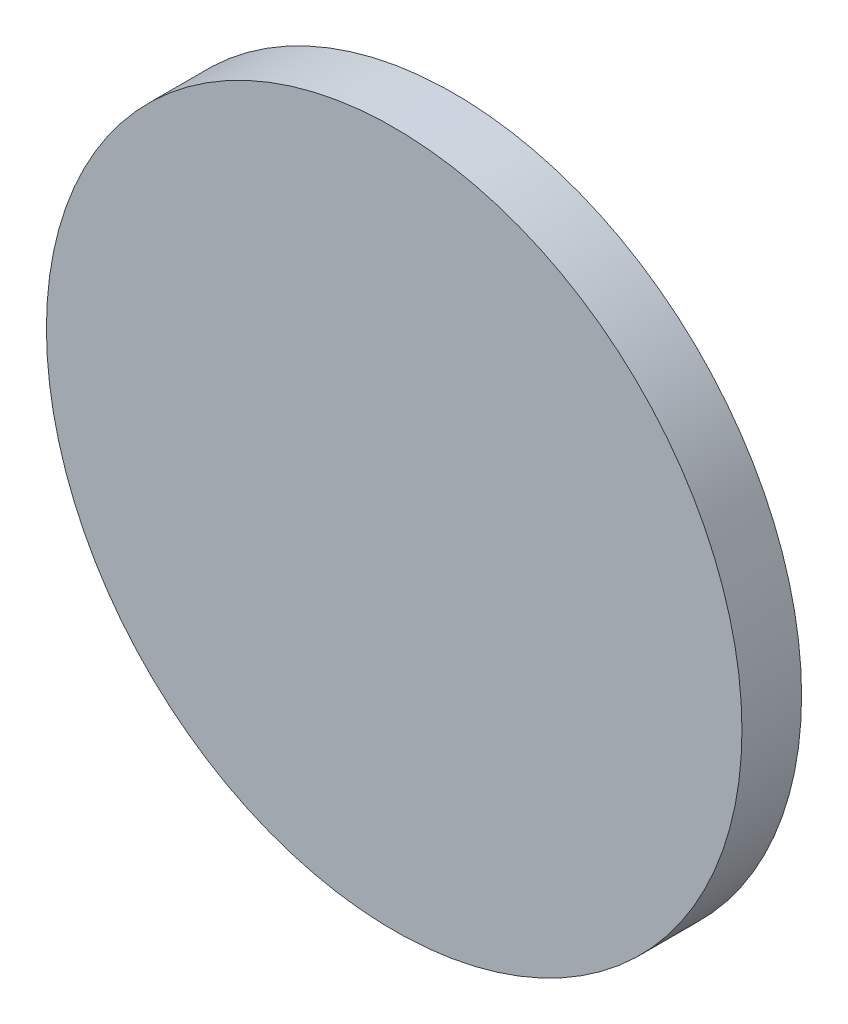
ISO-10303-21;
HEADER;
FILE_DESCRIPTION(('STEP AP214'),'2;1');
FILE_NAME('part.step','',(''),(''),'','','');
FILE_SCHEMA(('AUTOMOTIVE_DESIGN { 1 0 10303 214 1 1 1 1 }'));
ENDSEC;
DATA;
#1=APPLICATION_CONTEXT('core data for automotive mechanical design processes');
#2=APPLICATION_PROTOCOL_DEFINITION('international standard','automotive_design',2000,#1);
#3=PRODUCT_CONTEXT('',#1,'mechanical');
#4=PRODUCT('Part','Part','',(#3));
#5=PRODUCT_RELATED_PRODUCT_CATEGORY('part','',(#4));
#6=PRODUCT_DEFINITION_FORMATION('','',#4);
#7=PRODUCT_DEFINITION_CONTEXT('part definition',#1,'design');
#8=PRODUCT_DEFINITION('design','',#6,#7);
#9=PRODUCT_DEFINITION_SHAPE('','',#8);
#10=(LENGTH_UNIT() NAMED_UNIT(*) SI_UNIT(.MILLI.,.METRE.));
#11=(NAMED_UNIT(*) PLANE_ANGLE_UNIT() SI_UNIT($,.RADIAN.));
#12=(NAMED_UNIT(*) SI_UNIT($,.STERADIAN.) SOLID_ANGLE_UNIT());
#13=UNCERTAINTY_MEASURE_WITH_UNIT(LENGTH_MEASURE(1.E-05),#10,'distance_accuracy_value','');
#14=(GEOMETRIC_REPRESENTATION_CONTEXT(3) GLOBAL_UNCERTAINTY_ASSIGNED_CONTEXT((#13)) GLOBAL_UNIT_ASSIGNED_CONTEXT((#10,
#11,#12)) REPRESENTATION_CONTEXT('',''));
#15=CARTESIAN_POINT('',(0.,0.,0.));
#16=DIRECTION('',(0.,0.,1.));
#17=DIRECTION('',(1.,0.,0.));
#18=AXIS2_PLACEMENT_3D('',#15,#16,#17);
#19=CARTESIAN_POINT('',(5.918,9.291,0.));
#20=DIRECTION('',(0.,0.,-1.));
#21=DIRECTION('',(-1.,0.,0.));
#22=AXIS2_PLACEMENT_3D('',#19,#20,#21);
#23=PLANE('',#22);
#24=CARTESIAN_POINT('',(5.918,9.291,0.));
#25=DIRECTION('',(0.,0.,1.));
#26=DIRECTION('',(1.,0.,0.));
#27=AXIS2_PLACEMENT_3D('',#24,#25,#26);
#28=CIRCLE('',#27,0.200024667);
#29=CARTESIAN_POINT('',(6.118024667,9.291,0.));
#30=VERTEX_POINT('',#29);
#31=EDGE_CURVE('E18',#30,#30,#28,.T.);
#32=ORIENTED_EDGE('',*,*,#31,.F.);
#33=EDGE_LOOP('',(#32));
#34=FACE_BOUND('',#33,.T.);
#35=ADVANCED_FACE('F15',(#34),#23,.T.);
#36=CARTESIAN_POINT('',(5.918,9.291,0.));
#37=DIRECTION('',(0.,0.,1.));
#38=DIRECTION('',(1.,0.,0.));
#39=AXIS2_PLACEMENT_3D('',#36,#37,#38);
#40=CYLINDRICAL_SURFACE('',#39,0.200024667);
#41=CARTESIAN_POINT('',(5.918,9.291,0.03429));
#42=DIRECTION('',(0.,0.,1.));
#43=DIRECTION('',(1.,0.,0.));
#44=AXIS2_PLACEMENT_3D('',#41,#42,#43);
#45=CIRCLE('',#44,0.200024667);
#46=CARTESIAN_POINT('',(6.118024667,9.291,0.03429));
#47=VERTEX_POINT('',#46);
#48=EDGE_CURVE('E10',#47,#47,#45,.T.);
#49=ORIENTED_EDGE('',*,*,#48,.F.);
#50=EDGE_LOOP('',(#49));
#51=FACE_BOUND('',#50,.T.);
#52=ORIENTED_EDGE('',*,*,#31,.T.);
#53=EDGE_LOOP('',(#52));
#54=FACE_BOUND('',#53,.T.);
#55=ADVANCED_FACE('F27',(#51,#54),#40,.T.);
#56=CARTESIAN_POINT('',(5.918,9.291,0.03429));
#57=DIRECTION('',(0.,0.,1.));
#58=DIRECTION('',(1.,0.,0.));
#59=AXIS2_PLACEMENT_3D('',#56,#57,#58);
#60=PLANE('',#59);
#61=ORIENTED_EDGE('',*,*,#48,.T.);
#62=EDGE_LOOP('',(#61));
#63=FACE_BOUND('',#62,.T.);
#64=ADVANCED_FACE('F34',(#63),#60,.T.);
#65=CLOSED_SHELL('',(#35,#55,#64));
#66=MANIFOLD_SOLID_BREP('B1',#65);
#67=ADVANCED_BREP_SHAPE_REPRESENTATION('',(#18,#66),#14);
#68=SHAPE_DEFINITION_REPRESENTATION(#9,#67);
ENDSEC;
END-ISO-10303-21;
